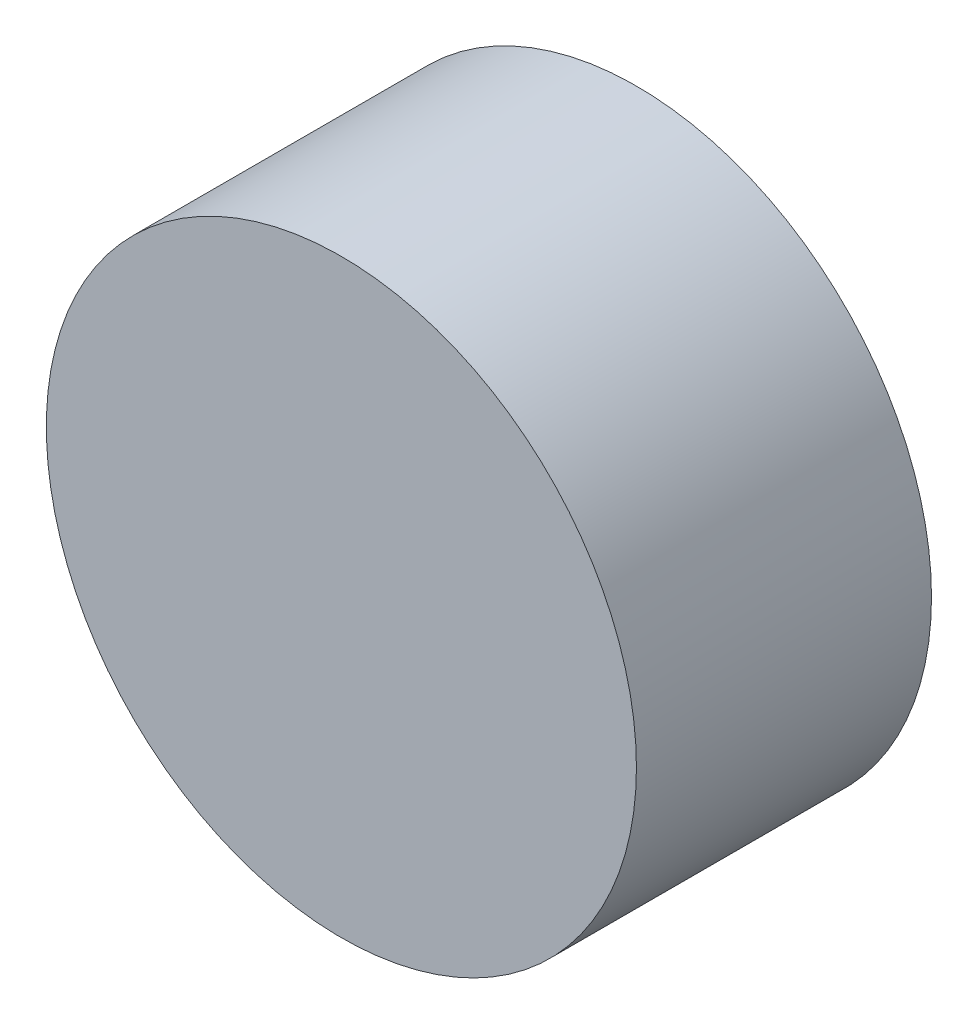
ISO-10303-21;
HEADER;
FILE_DESCRIPTION(('STEP AP214'),'2;1');
FILE_NAME('part.step','',(''),(''),'','','');
FILE_SCHEMA(('AUTOMOTIVE_DESIGN { 1 0 10303 214 1 1 1 1 }'));
ENDSEC;
DATA;
#1=APPLICATION_CONTEXT('core data for automotive mechanical design processes');
#2=APPLICATION_PROTOCOL_DEFINITION('international standard','automotive_design',2000,#1);
#3=PRODUCT_CONTEXT('',#1,'mechanical');
#4=PRODUCT('Part','Part','',(#3));
#5=PRODUCT_RELATED_PRODUCT_CATEGORY('part','',(#4));
#6=PRODUCT_DEFINITION_FORMATION('','',#4);
#7=PRODUCT_DEFINITION_CONTEXT('part definition',#1,'design');
#8=PRODUCT_DEFINITION('design','',#6,#7);
#9=PRODUCT_DEFINITION_SHAPE('','',#8);
#10=(LENGTH_UNIT() NAMED_UNIT(*) SI_UNIT(.MILLI.,.METRE.));
#11=(NAMED_UNIT(*) PLANE_ANGLE_UNIT() SI_UNIT($,.RADIAN.));
#12=(NAMED_UNIT(*) SI_UNIT($,.STERADIAN.) SOLID_ANGLE_UNIT());
#13=UNCERTAINTY_MEASURE_WITH_UNIT(LENGTH_MEASURE(1.E-05),#10,'distance_accuracy_value','');
#14=(GEOMETRIC_REPRESENTATION_CONTEXT(3) GLOBAL_UNCERTAINTY_ASSIGNED_CONTEXT((#13)) GLOBAL_UNIT_ASSIGNED_CONTEXT((#10,
#11,#12)) REPRESENTATION_CONTEXT('',''));
#15=CARTESIAN_POINT('',(0.,0.,0.));
#16=DIRECTION('',(0.,0.,1.));
#17=DIRECTION('',(1.,0.,0.));
#18=AXIS2_PLACEMENT_3D('',#15,#16,#17);
#19=CARTESIAN_POINT('',(0.,0.,50.8));
#20=DIRECTION('',(0.,0.,-1.));
#21=DIRECTION('',(-1.,0.,0.));
#22=AXIS2_PLACEMENT_3D('',#19,#20,#21);
#23=CYLINDRICAL_SURFACE('',#22,50.8);
#24=CARTESIAN_POINT('',(0.,0.,50.8));
#25=DIRECTION('',(0.,0.,1.));
#26=DIRECTION('',(1.,0.,0.));
#27=AXIS2_PLACEMENT_3D('',#24,#25,#26);
#28=CIRCLE('',#27,50.8);
#29=CARTESIAN_POINT('',(50.8,0.,50.8));
#30=VERTEX_POINT('',#29);
#31=EDGE_CURVE('E10',#30,#30,#28,.T.);
#32=ORIENTED_EDGE('',*,*,#31,.F.);
#33=EDGE_LOOP('',(#32));
#34=FACE_BOUND('',#33,.T.);
#35=CARTESIAN_POINT('',(0.,0.,0.));
#36=DIRECTION('',(0.,0.,1.));
#37=DIRECTION('',(1.,0.,0.));
#38=AXIS2_PLACEMENT_3D('',#35,#36,#37);
#39=CIRCLE('',#38,50.8);
#40=CARTESIAN_POINT('',(50.8,0.,0.));
#41=VERTEX_POINT('',#40);
#42=EDGE_CURVE('E40',#41,#41,#39,.T.);
#43=ORIENTED_EDGE('',*,*,#42,.T.);
#44=EDGE_LOOP('',(#43));
#45=FACE_BOUND('',#44,.T.);
#46=ADVANCED_FACE('F37',(#34,#45),#23,.T.);
#47=CARTESIAN_POINT('',(0.,0.,50.8));
#48=DIRECTION('',(0.,0.,1.));
#49=DIRECTION('',(1.,0.,0.));
#50=AXIS2_PLACEMENT_3D('',#47,#48,#49);
#51=PLANE('',#50);
#52=ORIENTED_EDGE('',*,*,#31,.T.);
#53=EDGE_LOOP('',(#52));
#54=FACE_BOUND('',#53,.T.);
#55=ADVANCED_FACE('F52',(#54),#51,.T.);
#56=CARTESIAN_POINT('',(0.,0.,0.));
#57=DIRECTION('',(0.,0.,1.));
#58=DIRECTION('',(1.,0.,0.));
#59=AXIS2_PLACEMENT_3D('',#56,#57,#58);
#60=PLANE('',#59);
#61=ORIENTED_EDGE('',*,*,#42,.F.);
#62=EDGE_LOOP('',(#61));
#63=FACE_BOUND('',#62,.T.);
#64=ADVANCED_FACE('F50',(#63),#60,.F.);
#65=CLOSED_SHELL('',(#46,#55,#64));
#66=MANIFOLD_SOLID_BREP('B2',#65);
#67=ADVANCED_BREP_SHAPE_REPRESENTATION('',(#18,#66),#14);
#68=SHAPE_DEFINITION_REPRESENTATION(#9,#67);
ENDSEC;
END-ISO-10303-21;
